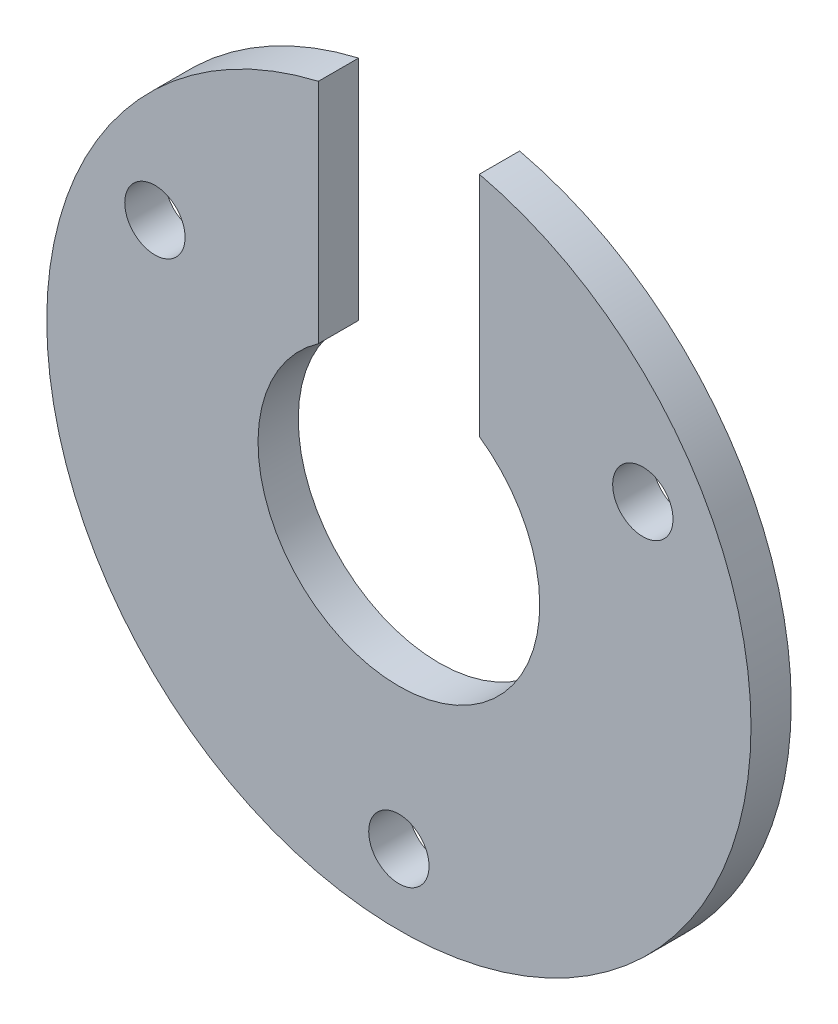
ISO-10303-21;
HEADER;
FILE_DESCRIPTION(('STEP AP214'),'2;1');
FILE_NAME('part.step','',(''),(''),'','','');
FILE_SCHEMA(('AUTOMOTIVE_DESIGN { 1 0 10303 214 1 1 1 1 }'));
ENDSEC;
DATA;
#1=APPLICATION_CONTEXT('core data for automotive mechanical design processes');
#2=APPLICATION_PROTOCOL_DEFINITION('international standard','automotive_design',2000,#1);
#3=PRODUCT_CONTEXT('',#1,'mechanical');
#4=PRODUCT('Part','Part','',(#3));
#5=PRODUCT_RELATED_PRODUCT_CATEGORY('part','',(#4));
#6=PRODUCT_DEFINITION_FORMATION('','',#4);
#7=PRODUCT_DEFINITION_CONTEXT('part definition',#1,'design');
#8=PRODUCT_DEFINITION('design','',#6,#7);
#9=PRODUCT_DEFINITION_SHAPE('','',#8);
#10=(LENGTH_UNIT() NAMED_UNIT(*) SI_UNIT(.MILLI.,.METRE.));
#11=(NAMED_UNIT(*) PLANE_ANGLE_UNIT() SI_UNIT($,.RADIAN.));
#12=(NAMED_UNIT(*) SI_UNIT($,.STERADIAN.) SOLID_ANGLE_UNIT());
#13=UNCERTAINTY_MEASURE_WITH_UNIT(LENGTH_MEASURE(1.E-05),#10,'distance_accuracy_value','');
#14=(GEOMETRIC_REPRESENTATION_CONTEXT(3) GLOBAL_UNCERTAINTY_ASSIGNED_CONTEXT((#13)) GLOBAL_UNIT_ASSIGNED_CONTEXT((#10,
#11,#12)) REPRESENTATION_CONTEXT('',''));
#15=CARTESIAN_POINT('',(0.,0.,0.));
#16=DIRECTION('',(0.,0.,1.));
#17=DIRECTION('',(1.,0.,0.));
#18=AXIS2_PLACEMENT_3D('',#15,#16,#17);
#19=CARTESIAN_POINT('',(0.,0.,2.));
#20=DIRECTION('',(0.,0.,1.));
#21=DIRECTION('',(1.,0.,0.));
#22=AXIS2_PLACEMENT_3D('',#19,#20,#21);
#23=PLANE('',#22);
#24=CARTESIAN_POINT('',(0.,-14.,2.));
#25=DIRECTION('',(0.,0.,-1.));
#26=DIRECTION('',(-1.,0.,0.));
#27=AXIS2_PLACEMENT_3D('',#24,#25,#26);
#28=CIRCLE('',#27,1.5);
#29=CARTESIAN_POINT('',(-1.5,-14.,2.));
#30=VERTEX_POINT('',#29);
#31=EDGE_CURVE('E113',#30,#30,#28,.T.);
#32=ORIENTED_EDGE('',*,*,#31,.T.);
#33=EDGE_LOOP('',(#32));
#34=FACE_BOUND('',#33,.T.);
#35=CARTESIAN_POINT('',(-12.1243556529822,6.99999999999997,2.));
#36=DIRECTION('',(0.,0.,-1.));
#37=DIRECTION('',(-1.,0.,0.));
#38=AXIS2_PLACEMENT_3D('',#35,#36,#37);
#39=CIRCLE('',#38,1.5);
#40=CARTESIAN_POINT('',(-13.6243556529822,6.99999999999997,2.));
#41=VERTEX_POINT('',#40);
#42=EDGE_CURVE('E107',#41,#41,#39,.T.);
#43=ORIENTED_EDGE('',*,*,#42,.T.);
#44=EDGE_LOOP('',(#43));
#45=FACE_BOUND('',#44,.T.);
#46=CARTESIAN_POINT('',(12.1243556529821,7.00000000000006,2.));
#47=DIRECTION('',(0.,0.,-1.));
#48=DIRECTION('',(-1.,0.,0.));
#49=AXIS2_PLACEMENT_3D('',#46,#47,#48);
#50=CIRCLE('',#49,1.5);
#51=CARTESIAN_POINT('',(10.6243556529821,7.00000000000006,2.));
#52=VERTEX_POINT('',#51);
#53=EDGE_CURVE('E88',#52,#52,#50,.T.);
#54=ORIENTED_EDGE('',*,*,#53,.T.);
#55=EDGE_LOOP('',(#54));
#56=FACE_BOUND('',#55,.T.);
#57=DIRECTION('',(0.,-1.,0.));
#58=VECTOR('',#57,1.);
#59=CARTESIAN_POINT('',(-4.,3.21601517861581,2.));
#60=LINE('',#59,#58);
#61=CARTESIAN_POINT('',(-4.,17.0367250374008,2.));
#62=VERTEX_POINT('',#61);
#63=CARTESIAN_POINT('',(-4.,5.74456264653803,2.));
#64=VERTEX_POINT('',#63);
#65=EDGE_CURVE('E53',#62,#64,#60,.T.);
#66=ORIENTED_EDGE('',*,*,#65,.F.);
#67=CARTESIAN_POINT('',(0.,0.,2.));
#68=DIRECTION('',(0.,0.,1.));
#69=DIRECTION('',(1.,0.,0.));
#70=AXIS2_PLACEMENT_3D('',#67,#68,#69);
#71=CIRCLE('',#70,17.5);
#72=CARTESIAN_POINT('',(4.,17.0367250374008,2.));
#73=VERTEX_POINT('',#72);
#74=EDGE_CURVE('E84',#62,#73,#71,.T.);
#75=ORIENTED_EDGE('',*,*,#74,.T.);
#76=DIRECTION('',(0.,1.,0.));
#77=VECTOR('',#76,1.);
#78=CARTESIAN_POINT('',(4.,3.21601517861581,2.));
#79=LINE('',#78,#77);
#80=CARTESIAN_POINT('',(4.,5.74456264653803,2.));
#81=VERTEX_POINT('',#80);
#82=EDGE_CURVE('E87',#81,#73,#79,.T.);
#83=ORIENTED_EDGE('',*,*,#82,.F.);
#84=CARTESIAN_POINT('',(0.,0.,2.));
#85=DIRECTION('',(0.,0.,1.));
#86=DIRECTION('',(1.,0.,0.));
#87=AXIS2_PLACEMENT_3D('',#84,#85,#86);
#88=CIRCLE('',#87,7.);
#89=EDGE_CURVE('E86',#64,#81,#88,.T.);
#90=ORIENTED_EDGE('',*,*,#89,.F.);
#91=EDGE_LOOP('',(#66,#75,#83,#90));
#92=FACE_BOUND('',#91,.T.);
#93=ADVANCED_FACE('F31',(#34,#45,#56,#92),#23,.T.);
#94=CARTESIAN_POINT('',(0.,0.,0.));
#95=DIRECTION('',(0.,0.,1.));
#96=DIRECTION('',(1.,0.,0.));
#97=AXIS2_PLACEMENT_3D('',#94,#95,#96);
#98=PLANE('',#97);
#99=CARTESIAN_POINT('',(0.,-14.,0.));
#100=DIRECTION('',(0.,0.,-1.));
#101=DIRECTION('',(-1.,0.,0.));
#102=AXIS2_PLACEMENT_3D('',#99,#100,#101);
#103=CIRCLE('',#102,1.49999999999999);
#104=CARTESIAN_POINT('',(-1.49999999999999,-14.,0.));
#105=VERTEX_POINT('',#104);
#106=EDGE_CURVE('E116',#105,#105,#103,.T.);
#107=ORIENTED_EDGE('',*,*,#106,.F.);
#108=EDGE_LOOP('',(#107));
#109=FACE_BOUND('',#108,.T.);
#110=CARTESIAN_POINT('',(-12.1243556529822,6.99999999999997,0.));
#111=DIRECTION('',(0.,0.,-1.));
#112=DIRECTION('',(-1.,0.,0.));
#113=AXIS2_PLACEMENT_3D('',#110,#111,#112);
#114=CIRCLE('',#113,1.49999999999999);
#115=CARTESIAN_POINT('',(-13.6243556529821,6.99999999999997,0.));
#116=VERTEX_POINT('',#115);
#117=EDGE_CURVE('E110',#116,#116,#114,.T.);
#118=ORIENTED_EDGE('',*,*,#117,.F.);
#119=EDGE_LOOP('',(#118));
#120=FACE_BOUND('',#119,.T.);
#121=CARTESIAN_POINT('',(12.1243556529821,7.00000000000006,0.));
#122=DIRECTION('',(0.,0.,-1.));
#123=DIRECTION('',(-1.,0.,0.));
#124=AXIS2_PLACEMENT_3D('',#121,#122,#123);
#125=CIRCLE('',#124,1.49999999999999);
#126=CARTESIAN_POINT('',(10.6243556529821,7.00000000000006,0.));
#127=VERTEX_POINT('',#126);
#128=EDGE_CURVE('E104',#127,#127,#125,.T.);
#129=ORIENTED_EDGE('',*,*,#128,.F.);
#130=EDGE_LOOP('',(#129));
#131=FACE_BOUND('',#130,.T.);
#132=CARTESIAN_POINT('',(0.,0.,0.));
#133=DIRECTION('',(0.,0.,1.));
#134=DIRECTION('',(1.,0.,0.));
#135=AXIS2_PLACEMENT_3D('',#132,#133,#134);
#136=CIRCLE('',#135,17.5);
#137=CARTESIAN_POINT('',(-4.,17.0367250374008,0.));
#138=VERTEX_POINT('',#137);
#139=CARTESIAN_POINT('',(4.,17.0367250374008,0.));
#140=VERTEX_POINT('',#139);
#141=EDGE_CURVE('E91',#138,#140,#136,.T.);
#142=ORIENTED_EDGE('',*,*,#141,.F.);
#143=DIRECTION('',(0.,-1.,0.));
#144=VECTOR('',#143,1.);
#145=CARTESIAN_POINT('',(-4.,3.21601517861581,0.));
#146=LINE('',#145,#144);
#147=CARTESIAN_POINT('',(-4.,5.74456264653803,0.));
#148=VERTEX_POINT('',#147);
#149=EDGE_CURVE('E72',#138,#148,#146,.T.);
#150=ORIENTED_EDGE('',*,*,#149,.T.);
#151=CARTESIAN_POINT('',(0.,0.,0.));
#152=DIRECTION('',(0.,0.,1.));
#153=DIRECTION('',(1.,0.,0.));
#154=AXIS2_PLACEMENT_3D('',#151,#152,#153);
#155=CIRCLE('',#154,7.);
#156=CARTESIAN_POINT('',(4.,5.74456264653803,0.));
#157=VERTEX_POINT('',#156);
#158=EDGE_CURVE('E77',#148,#157,#155,.T.);
#159=ORIENTED_EDGE('',*,*,#158,.T.);
#160=DIRECTION('',(0.,1.,0.));
#161=VECTOR('',#160,1.);
#162=CARTESIAN_POINT('',(4.,3.21601517861581,0.));
#163=LINE('',#162,#161);
#164=EDGE_CURVE('E46',#157,#140,#163,.T.);
#165=ORIENTED_EDGE('',*,*,#164,.T.);
#166=EDGE_LOOP('',(#142,#150,#159,#165));
#167=FACE_BOUND('',#166,.T.);
#168=ADVANCED_FACE('F122',(#109,#120,#131,#167),#98,.F.);
#169=CARTESIAN_POINT('',(0.,0.,2.));
#170=DIRECTION('',(0.,0.,-1.));
#171=DIRECTION('',(-1.,0.,0.));
#172=AXIS2_PLACEMENT_3D('',#169,#170,#171);
#173=CYLINDRICAL_SURFACE('',#172,17.5);
#174=ORIENTED_EDGE('',*,*,#74,.F.);
#175=DIRECTION('',(0.,0.,-1.));
#176=VECTOR('',#175,1.);
#177=CARTESIAN_POINT('',(-4.,17.0367250374008,2.));
#178=LINE('',#177,#176);
#179=EDGE_CURVE('E69',#62,#138,#178,.T.);
#180=ORIENTED_EDGE('',*,*,#179,.T.);
#181=ORIENTED_EDGE('',*,*,#141,.T.);
#182=DIRECTION('',(0.,0.,-1.));
#183=VECTOR('',#182,1.);
#184=CARTESIAN_POINT('',(4.,17.0367250374008,2.));
#185=LINE('',#184,#183);
#186=EDGE_CURVE('E78',#140,#73,#185,.F.);
#187=ORIENTED_EDGE('',*,*,#186,.T.);
#188=EDGE_LOOP('',(#174,#180,#181,#187));
#189=FACE_BOUND('',#188,.T.);
#190=ADVANCED_FACE('F33',(#189),#173,.T.);
#191=CARTESIAN_POINT('',(0.,0.,2.));
#192=DIRECTION('',(0.,0.,-1.));
#193=DIRECTION('',(-1.,0.,0.));
#194=AXIS2_PLACEMENT_3D('',#191,#192,#193);
#195=CYLINDRICAL_SURFACE('',#194,7.);
#196=DIRECTION('',(0.,0.,-1.));
#197=VECTOR('',#196,1.);
#198=CARTESIAN_POINT('',(-4.,5.74456264653803,2.));
#199=LINE('',#198,#197);
#200=EDGE_CURVE('E11',#64,#148,#199,.T.);
#201=ORIENTED_EDGE('',*,*,#200,.F.);
#202=ORIENTED_EDGE('',*,*,#89,.T.);
#203=DIRECTION('',(0.,0.,-1.));
#204=VECTOR('',#203,1.);
#205=CARTESIAN_POINT('',(4.,5.74456264653803,2.));
#206=LINE('',#205,#204);
#207=EDGE_CURVE('E39',#157,#81,#206,.F.);
#208=ORIENTED_EDGE('',*,*,#207,.F.);
#209=ORIENTED_EDGE('',*,*,#158,.F.);
#210=EDGE_LOOP('',(#201,#202,#208,#209));
#211=FACE_BOUND('',#210,.T.);
#212=ADVANCED_FACE('F131',(#211),#195,.F.);
#213=CARTESIAN_POINT('',(4.,3.21601517861581,0.));
#214=DIRECTION('',(1.,0.,0.));
#215=DIRECTION('',(0.,0.,-1.));
#216=AXIS2_PLACEMENT_3D('',#213,#214,#215);
#217=PLANE('',#216);
#218=ORIENTED_EDGE('',*,*,#164,.F.);
#219=ORIENTED_EDGE('',*,*,#207,.T.);
#220=ORIENTED_EDGE('',*,*,#82,.T.);
#221=ORIENTED_EDGE('',*,*,#186,.F.);
#222=EDGE_LOOP('',(#218,#219,#220,#221));
#223=FACE_BOUND('',#222,.T.);
#224=ADVANCED_FACE('F132',(#223),#217,.F.);
#225=CARTESIAN_POINT('',(-4.,3.21601517861581,0.));
#226=DIRECTION('',(-1.,0.,0.));
#227=DIRECTION('',(0.,0.,1.));
#228=AXIS2_PLACEMENT_3D('',#225,#226,#227);
#229=PLANE('',#228);
#230=ORIENTED_EDGE('',*,*,#65,.T.);
#231=ORIENTED_EDGE('',*,*,#200,.T.);
#232=ORIENTED_EDGE('',*,*,#149,.F.);
#233=ORIENTED_EDGE('',*,*,#179,.F.);
#234=EDGE_LOOP('',(#230,#231,#232,#233));
#235=FACE_BOUND('',#234,.T.);
#236=ADVANCED_FACE('F70',(#235),#229,.F.);
#237=CARTESIAN_POINT('',(12.1243556529821,7.00000000000006,0.));
#238=DIRECTION('',(0.,0.,-1.));
#239=DIRECTION('',(-1.,0.,0.));
#240=AXIS2_PLACEMENT_3D('',#237,#238,#239);
#241=CYLINDRICAL_SURFACE('',#240,1.49999999999999);
#242=ORIENTED_EDGE('',*,*,#53,.F.);
#243=EDGE_LOOP('',(#242));
#244=FACE_BOUND('',#243,.T.);
#245=ORIENTED_EDGE('',*,*,#128,.T.);
#246=EDGE_LOOP('',(#245));
#247=FACE_BOUND('',#246,.T.);
#248=ADVANCED_FACE('F139',(#244,#247),#241,.F.);
#249=CARTESIAN_POINT('',(-12.1243556529822,6.99999999999997,0.));
#250=DIRECTION('',(0.,0.,-1.));
#251=DIRECTION('',(-1.,0.,0.));
#252=AXIS2_PLACEMENT_3D('',#249,#250,#251);
#253=CYLINDRICAL_SURFACE('',#252,1.49999999999999);
#254=ORIENTED_EDGE('',*,*,#42,.F.);
#255=EDGE_LOOP('',(#254));
#256=FACE_BOUND('',#255,.T.);
#257=ORIENTED_EDGE('',*,*,#117,.T.);
#258=EDGE_LOOP('',(#257));
#259=FACE_BOUND('',#258,.T.);
#260=ADVANCED_FACE('F156',(#256,#259),#253,.F.);
#261=CARTESIAN_POINT('',(0.,-14.,0.));
#262=DIRECTION('',(0.,0.,-1.));
#263=DIRECTION('',(-1.,0.,0.));
#264=AXIS2_PLACEMENT_3D('',#261,#262,#263);
#265=CYLINDRICAL_SURFACE('',#264,1.49999999999999);
#266=ORIENTED_EDGE('',*,*,#31,.F.);
#267=EDGE_LOOP('',(#266));
#268=FACE_BOUND('',#267,.T.);
#269=ORIENTED_EDGE('',*,*,#106,.T.);
#270=EDGE_LOOP('',(#269));
#271=FACE_BOUND('',#270,.T.);
#272=ADVANCED_FACE('F120',(#268,#271),#265,.F.);
#273=CLOSED_SHELL('',(#93,#168,#190,#212,#224,#236,#248,#260,#272));
#274=MANIFOLD_SOLID_BREP('B2',#273);
#275=ADVANCED_BREP_SHAPE_REPRESENTATION('',(#18,#274),#14);
#276=SHAPE_DEFINITION_REPRESENTATION(#9,#275);
ENDSEC;
END-ISO-10303-21;
